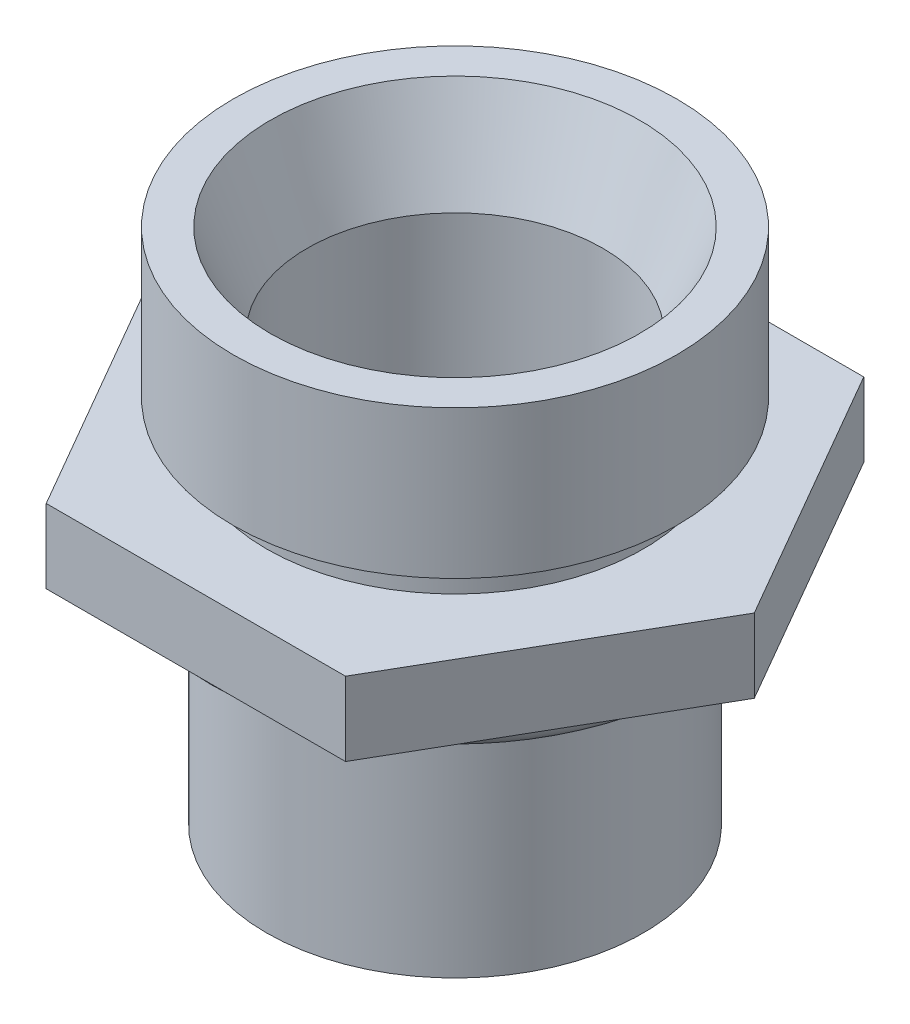
ISO-10303-21;
HEADER;
FILE_DESCRIPTION(('STEP AP214'),'2;1');
FILE_NAME('part.step','',(''),(''),'','','');
FILE_SCHEMA(('AUTOMOTIVE_DESIGN { 1 0 10303 214 1 1 1 1 }'));
ENDSEC;
DATA;
#1=APPLICATION_CONTEXT('core data for automotive mechanical design processes');
#2=APPLICATION_PROTOCOL_DEFINITION('international standard','automotive_design',2000,#1);
#3=PRODUCT_CONTEXT('',#1,'mechanical');
#4=PRODUCT('Part','Part','',(#3));
#5=PRODUCT_RELATED_PRODUCT_CATEGORY('part','',(#4));
#6=PRODUCT_DEFINITION_FORMATION('','',#4);
#7=PRODUCT_DEFINITION_CONTEXT('part definition',#1,'design');
#8=PRODUCT_DEFINITION('design','',#6,#7);
#9=PRODUCT_DEFINITION_SHAPE('','',#8);
#10=(LENGTH_UNIT() NAMED_UNIT(*) SI_UNIT(.MILLI.,.METRE.));
#11=(NAMED_UNIT(*) PLANE_ANGLE_UNIT() SI_UNIT($,.RADIAN.));
#12=(NAMED_UNIT(*) SI_UNIT($,.STERADIAN.) SOLID_ANGLE_UNIT());
#13=UNCERTAINTY_MEASURE_WITH_UNIT(LENGTH_MEASURE(1.E-05),#10,'distance_accuracy_value','');
#14=(GEOMETRIC_REPRESENTATION_CONTEXT(3) GLOBAL_UNCERTAINTY_ASSIGNED_CONTEXT((#13)) GLOBAL_UNIT_ASSIGNED_CONTEXT((#10,
#11,#12)) REPRESENTATION_CONTEXT('',''));
#15=CARTESIAN_POINT('',(0.,0.,0.));
#16=DIRECTION('',(0.,0.,1.));
#17=DIRECTION('',(1.,0.,0.));
#18=AXIS2_PLACEMENT_3D('',#15,#16,#17);
#19=CARTESIAN_POINT('',(0.,1.53750572311923,0.));
#20=DIRECTION('',(0.,1.,0.));
#21=DIRECTION('',(0.,0.,1.));
#22=AXIS2_PLACEMENT_3D('',#19,#20,#21);
#23=TOROIDAL_SURFACE('',#22,6.,0.8);
#24=CARTESIAN_POINT('',(0.,1.53750572311923,6.8));
#25=VERTEX_POINT('',#24);
#26=VERTEX_LOOP('',#25);
#27=FACE_BOUND('',#26,.T.);
#28=ADVANCED_FACE('F41',(#27),#23,.T.);
#29=CLOSED_SHELL('',(#28));
#30=MANIFOLD_SOLID_BREP('B2',#29);
#31=CARTESIAN_POINT('',(-8.1,1.43750572311923,0.));
#32=DIRECTION('',(0.,-1.,0.));
#33=DIRECTION('',(0.,0.,-1.));
#34=AXIS2_PLACEMENT_3D('',#31,#32,#33);
#35=PLANE('',#34);
#36=CARTESIAN_POINT('',(0.,1.43750572311923,0.));
#37=DIRECTION('',(0.,1.,0.));
#38=DIRECTION('',(0.,0.,1.));
#39=AXIS2_PLACEMENT_3D('',#36,#37,#38);
#40=CIRCLE('',#39,6.9);
#41=CARTESIAN_POINT('',(0.,1.43750572311923,6.9));
#42=VERTEX_POINT('',#41);
#43=EDGE_CURVE('E39',#42,#42,#40,.T.);
#44=ORIENTED_EDGE('',*,*,#43,.T.);
#45=EDGE_LOOP('',(#44));
#46=FACE_BOUND('',#45,.T.);
#47=DIRECTION('',(-0.999999992377329,0.,0.000123472032622339));
#48=VECTOR('',#47,1.);
#49=CARTESIAN_POINT('',(-8.09913385110908,1.43750572311923,7.01493986870678));
#50=LINE('',#49,#48);
#51=CARTESIAN_POINT('',(4.05036602540365,1.43750572311923,7.01343974525025));
#52=VERTEX_POINT('',#51);
#53=CARTESIAN_POINT('',(-4.04863397459637,1.43750572311923,7.01443974525008));
#54=VERTEX_POINT('',#53);
#55=EDGE_CURVE('E139',#52,#54,#50,.T.);
#56=ORIENTED_EDGE('',*,*,#55,.T.);
#57=DIRECTION('',(-0.500146037239615,0.,-0.8659410727258));
#58=VECTOR('',#57,1.);
#59=CARTESIAN_POINT('',(-8.1,1.43750572311923,0.));
#60=LINE('',#59,#58);
#61=CARTESIAN_POINT('',(-8.1,1.43750572311923,0.));
#62=VERTEX_POINT('',#61);
#63=EDGE_CURVE('E156',#54,#62,#60,.T.);
#64=ORIENTED_EDGE('',*,*,#63,.T.);
#65=DIRECTION('',(0.500039140324542,0.,-0.86600280492819));
#66=VECTOR('',#65,1.);
#67=CARTESIAN_POINT('',(-8.1,1.43750572311923,0.));
#68=LINE('',#67,#66);
#69=CARTESIAN_POINT('',(-4.05036602540369,1.43750572311923,-7.01343974525022));
#70=VERTEX_POINT('',#69);
#71=EDGE_CURVE('E153',#62,#70,#68,.T.);
#72=ORIENTED_EDGE('',*,*,#71,.T.);
#73=DIRECTION('',(0.999999992377329,0.,-0.000123472032629407));
#74=VECTOR('',#73,1.);
#75=CARTESIAN_POINT('',(-8.10086590191641,1.43750572311923,-7.01293962179349));
#76=LINE('',#75,#74);
#77=CARTESIAN_POINT('',(4.04863397459632,1.43750572311923,-7.01443974525011));
#78=VERTEX_POINT('',#77);
#79=EDGE_CURVE('E150',#70,#78,#76,.T.);
#80=ORIENTED_EDGE('',*,*,#79,.T.);
#81=DIRECTION('',(0.500146037239615,0.,0.8659410727258));
#82=VECTOR('',#81,1.);
#83=CARTESIAN_POINT('',(4.04763385122284,1.43750572311923,-7.01617133531064));
#84=LINE('',#83,#82);
#85=CARTESIAN_POINT('',(8.09999999999997,1.43750572311923,0.));
#86=VERTEX_POINT('',#85);
#87=EDGE_CURVE('E148',#78,#86,#84,.T.);
#88=ORIENTED_EDGE('',*,*,#87,.T.);
#89=DIRECTION('',(-0.500039140324542,0.,0.86600280492819));
#90=VECTOR('',#89,1.);
#91=CARTESIAN_POINT('',(4.04936590192456,1.43750572311923,7.01517182913792));
#92=LINE('',#91,#90);
#93=EDGE_CURVE('E109',#86,#52,#92,.T.);
#94=ORIENTED_EDGE('',*,*,#93,.T.);
#95=EDGE_LOOP('',(#56,#64,#72,#80,#88,#94));
#96=FACE_BOUND('',#95,.T.);
#97=ADVANCED_FACE('F54',(#46,#96),#35,.T.);
#98=CARTESIAN_POINT('',(-5.1,3.43750572311923,0.));
#99=DIRECTION('',(0.,1.,0.));
#100=DIRECTION('',(0.,0.,1.));
#101=AXIS2_PLACEMENT_3D('',#98,#99,#100);
#102=PLANE('',#101);
#103=CARTESIAN_POINT('',(0.,3.43750572311923,0.));
#104=DIRECTION('',(0.,1.,0.));
#105=DIRECTION('',(0.,0.,1.));
#106=AXIS2_PLACEMENT_3D('',#103,#104,#105);
#107=CIRCLE('',#106,5.1);
#108=CARTESIAN_POINT('',(0.,3.43750572311923,5.1));
#109=VERTEX_POINT('',#108);
#110=EDGE_CURVE('E159',#109,#109,#107,.T.);
#111=ORIENTED_EDGE('',*,*,#110,.F.);
#112=EDGE_LOOP('',(#111));
#113=FACE_BOUND('',#112,.T.);
#114=DIRECTION('',(-0.500039140324542,0.,0.86600280492819));
#115=VECTOR('',#114,1.);
#116=CARTESIAN_POINT('',(-8.1,3.43750572311923,0.));
#117=LINE('',#116,#115);
#118=CARTESIAN_POINT('',(-4.05036602540369,3.43750572311923,-7.01343974525022));
#119=VERTEX_POINT('',#118);
#120=CARTESIAN_POINT('',(-8.1,3.43750572311923,0.));
#121=VERTEX_POINT('',#120);
#122=EDGE_CURVE('E135',#119,#121,#117,.T.);
#123=ORIENTED_EDGE('',*,*,#122,.T.);
#124=DIRECTION('',(0.500146037239615,0.,0.8659410727258));
#125=VECTOR('',#124,1.);
#126=CARTESIAN_POINT('',(-4.04863397459637,3.43750572311923,7.01443974525008));
#127=LINE('',#126,#125);
#128=CARTESIAN_POINT('',(-4.04863397459637,3.43750572311923,7.01443974525008));
#129=VERTEX_POINT('',#128);
#130=EDGE_CURVE('E130',#121,#129,#127,.T.);
#131=ORIENTED_EDGE('',*,*,#130,.T.);
#132=DIRECTION('',(0.999999992377328,0.,-0.000123472032622339));
#133=VECTOR('',#132,1.);
#134=CARTESIAN_POINT('',(4.05036602540365,3.43750572311923,7.01343974525025));
#135=LINE('',#134,#133);
#136=CARTESIAN_POINT('',(4.05036602540365,3.43750572311923,7.01343974525025));
#137=VERTEX_POINT('',#136);
#138=EDGE_CURVE('E128',#129,#137,#135,.T.);
#139=ORIENTED_EDGE('',*,*,#138,.T.);
#140=DIRECTION('',(0.500039140324542,0.,-0.86600280492819));
#141=VECTOR('',#140,1.);
#142=CARTESIAN_POINT('',(8.09999999999997,3.43750572311923,0.));
#143=LINE('',#142,#141);
#144=CARTESIAN_POINT('',(8.09999999999997,3.43750572311923,0.));
#145=VERTEX_POINT('',#144);
#146=EDGE_CURVE('E76',#137,#145,#143,.T.);
#147=ORIENTED_EDGE('',*,*,#146,.T.);
#148=DIRECTION('',(-0.500146037239615,0.,-0.8659410727258));
#149=VECTOR('',#148,1.);
#150=CARTESIAN_POINT('',(4.04863397459632,3.43750572311923,-7.01443974525011));
#151=LINE('',#150,#149);
#152=CARTESIAN_POINT('',(4.04863397459632,3.43750572311923,-7.01443974525011));
#153=VERTEX_POINT('',#152);
#154=EDGE_CURVE('E116',#145,#153,#151,.T.);
#155=ORIENTED_EDGE('',*,*,#154,.T.);
#156=DIRECTION('',(-0.999999992377328,0.,0.000123472032629407));
#157=VECTOR('',#156,1.);
#158=CARTESIAN_POINT('',(-4.05036602540369,3.43750572311923,-7.01343974525022));
#159=LINE('',#158,#157);
#160=EDGE_CURVE('E122',#153,#119,#159,.T.);
#161=ORIENTED_EDGE('',*,*,#160,.T.);
#162=EDGE_LOOP('',(#123,#131,#139,#147,#155,#161));
#163=FACE_BOUND('',#162,.T.);
#164=ADVANCED_FACE('F126',(#113,#163),#102,.T.);
#165=CARTESIAN_POINT('',(0.,12.4404147941523,0.));
#166=DIRECTION('',(0.,1.,0.));
#167=DIRECTION('',(0.,0.,1.));
#168=AXIS2_PLACEMENT_3D('',#165,#166,#167);
#169=CYLINDRICAL_SURFACE('',#168,6.9);
#170=CARTESIAN_POINT('',(0.,2.43750572311923,0.));
#171=DIRECTION('',(0.,1.,0.));
#172=DIRECTION('',(0.,0.,1.));
#173=AXIS2_PLACEMENT_3D('',#170,#171,#172);
#174=CIRCLE('',#173,6.9);
#175=CARTESIAN_POINT('',(0.,2.43750572311923,6.9));
#176=VERTEX_POINT('',#175);
#177=EDGE_CURVE('E61',#176,#176,#174,.T.);
#178=ORIENTED_EDGE('',*,*,#177,.T.);
#179=EDGE_LOOP('',(#178));
#180=FACE_BOUND('',#179,.T.);
#181=ORIENTED_EDGE('',*,*,#43,.F.);
#182=EDGE_LOOP('',(#181));
#183=FACE_BOUND('',#182,.T.);
#184=ADVANCED_FACE('F188',(#180,#183),#169,.F.);
#185=CARTESIAN_POINT('',(-6.9,2.43750572311923,0.));
#186=DIRECTION('',(0.,-1.,0.));
#187=DIRECTION('',(0.,0.,-1.));
#188=AXIS2_PLACEMENT_3D('',#185,#186,#187);
#189=PLANE('',#188);
#190=CARTESIAN_POINT('',(0.,2.43750572311923,0.));
#191=DIRECTION('',(0.,1.,0.));
#192=DIRECTION('',(0.,0.,1.));
#193=AXIS2_PLACEMENT_3D('',#190,#191,#192);
#194=CIRCLE('',#193,5.1);
#195=CARTESIAN_POINT('',(0.,2.43750572311923,5.1));
#196=VERTEX_POINT('',#195);
#197=EDGE_CURVE('E183',#196,#196,#194,.T.);
#198=ORIENTED_EDGE('',*,*,#197,.T.);
#199=EDGE_LOOP('',(#198));
#200=FACE_BOUND('',#199,.T.);
#201=ORIENTED_EDGE('',*,*,#177,.F.);
#202=EDGE_LOOP('',(#201));
#203=FACE_BOUND('',#202,.T.);
#204=ADVANCED_FACE('F191',(#200,#203),#189,.T.);
#205=CARTESIAN_POINT('',(0.,12.4404147941523,0.));
#206=DIRECTION('',(0.,1.,0.));
#207=DIRECTION('',(0.,0.,1.));
#208=AXIS2_PLACEMENT_3D('',#205,#206,#207);
#209=CYLINDRICAL_SURFACE('',#208,5.1);
#210=CARTESIAN_POINT('',(0.,-5.56249427688077,0.));
#211=DIRECTION('',(0.,1.,0.));
#212=DIRECTION('',(0.,0.,1.));
#213=AXIS2_PLACEMENT_3D('',#210,#211,#212);
#214=CIRCLE('',#213,5.1);
#215=CARTESIAN_POINT('',(0.,-5.56249427688077,5.1));
#216=VERTEX_POINT('',#215);
#217=EDGE_CURVE('E180',#216,#216,#214,.T.);
#218=ORIENTED_EDGE('',*,*,#217,.T.);
#219=EDGE_LOOP('',(#218));
#220=FACE_BOUND('',#219,.T.);
#221=ORIENTED_EDGE('',*,*,#197,.F.);
#222=EDGE_LOOP('',(#221));
#223=FACE_BOUND('',#222,.T.);
#224=ADVANCED_FACE('F193',(#220,#223),#209,.T.);
#225=CARTESIAN_POINT('',(-5.1,-5.56249427688077,0.));
#226=DIRECTION('',(0.,-1.,0.));
#227=DIRECTION('',(0.,0.,-1.));
#228=AXIS2_PLACEMENT_3D('',#225,#226,#227);
#229=PLANE('',#228);
#230=CARTESIAN_POINT('',(0.,-5.56249427688077,0.));
#231=DIRECTION('',(0.,1.,0.));
#232=DIRECTION('',(0.,0.,1.));
#233=AXIS2_PLACEMENT_3D('',#230,#231,#232);
#234=CIRCLE('',#233,3.99999999999999);
#235=CARTESIAN_POINT('',(0.,-5.56249427688077,3.99999999999999));
#236=VERTEX_POINT('',#235);
#237=EDGE_CURVE('E177',#236,#236,#234,.T.);
#238=ORIENTED_EDGE('',*,*,#237,.T.);
#239=EDGE_LOOP('',(#238));
#240=FACE_BOUND('',#239,.T.);
#241=ORIENTED_EDGE('',*,*,#217,.F.);
#242=EDGE_LOOP('',(#241));
#243=FACE_BOUND('',#242,.T.);
#244=ADVANCED_FACE('F200',(#240,#243),#229,.T.);
#245=CARTESIAN_POINT('',(0.,12.4404147941523,0.));
#246=DIRECTION('',(0.,1.,0.));
#247=DIRECTION('',(0.,0.,1.));
#248=AXIS2_PLACEMENT_3D('',#245,#246,#247);
#249=CYLINDRICAL_SURFACE('',#248,3.99999999999999);
#250=CARTESIAN_POINT('',(0.,5.93750572311923,0.));
#251=DIRECTION('',(0.,1.,0.));
#252=DIRECTION('',(0.,0.,1.));
#253=AXIS2_PLACEMENT_3D('',#250,#251,#252);
#254=CIRCLE('',#253,3.99999999999999);
#255=CARTESIAN_POINT('',(0.,5.93750572311923,3.99999999999999));
#256=VERTEX_POINT('',#255);
#257=EDGE_CURVE('E174',#256,#256,#254,.T.);
#258=ORIENTED_EDGE('',*,*,#257,.T.);
#259=EDGE_LOOP('',(#258));
#260=FACE_BOUND('',#259,.T.);
#261=ORIENTED_EDGE('',*,*,#237,.F.);
#262=EDGE_LOOP('',(#261));
#263=FACE_BOUND('',#262,.T.);
#264=ADVANCED_FACE('F258',(#260,#263),#249,.F.);
#265=CARTESIAN_POINT('',(0.,5.93750572311923,0.));
#266=DIRECTION('',(0.,1.,0.));
#267=DIRECTION('',(0.,0.,1.));
#268=AXIS2_PLACEMENT_3D('',#265,#266,#267);
#269=CONICAL_SURFACE('',#268,3.99999999999999,0.380506377112361);
#270=CARTESIAN_POINT('',(0.,8.43750572311923,0.));
#271=DIRECTION('',(0.,1.,0.));
#272=DIRECTION('',(0.,0.,1.));
#273=AXIS2_PLACEMENT_3D('',#270,#271,#272);
#274=CIRCLE('',#273,4.99999999999998);
#275=CARTESIAN_POINT('',(0.,8.43750572311923,4.99999999999998));
#276=VERTEX_POINT('',#275);
#277=EDGE_CURVE('E171',#276,#276,#274,.T.);
#278=ORIENTED_EDGE('',*,*,#277,.T.);
#279=EDGE_LOOP('',(#278));
#280=FACE_BOUND('',#279,.T.);
#281=ORIENTED_EDGE('',*,*,#257,.F.);
#282=EDGE_LOOP('',(#281));
#283=FACE_BOUND('',#282,.T.);
#284=ADVANCED_FACE('F254',(#280,#283),#269,.F.);
#285=CARTESIAN_POINT('',(-6.,8.43750572311923,0.));
#286=DIRECTION('',(0.,1.,0.));
#287=DIRECTION('',(0.,0.,1.));
#288=AXIS2_PLACEMENT_3D('',#285,#286,#287);
#289=PLANE('',#288);
#290=CARTESIAN_POINT('',(0.,8.43750572311923,0.));
#291=DIRECTION('',(0.,1.,0.));
#292=DIRECTION('',(0.,0.,1.));
#293=AXIS2_PLACEMENT_3D('',#290,#291,#292);
#294=CIRCLE('',#293,6.);
#295=CARTESIAN_POINT('',(0.,8.43750572311923,6.));
#296=VERTEX_POINT('',#295);
#297=EDGE_CURVE('E168',#296,#296,#294,.T.);
#298=ORIENTED_EDGE('',*,*,#297,.T.);
#299=EDGE_LOOP('',(#298));
#300=FACE_BOUND('',#299,.T.);
#301=ORIENTED_EDGE('',*,*,#277,.F.);
#302=EDGE_LOOP('',(#301));
#303=FACE_BOUND('',#302,.T.);
#304=ADVANCED_FACE('F250',(#300,#303),#289,.T.);
#305=CARTESIAN_POINT('',(0.,12.4404147941523,0.));
#306=DIRECTION('',(0.,1.,0.));
#307=DIRECTION('',(0.,0.,1.));
#308=AXIS2_PLACEMENT_3D('',#305,#306,#307);
#309=CYLINDRICAL_SURFACE('',#308,5.99999999999999);
#310=CARTESIAN_POINT('',(0.,4.43750572311923,0.));
#311=DIRECTION('',(0.,1.,0.));
#312=DIRECTION('',(0.,0.,1.));
#313=AXIS2_PLACEMENT_3D('',#310,#311,#312);
#314=CIRCLE('',#313,5.99999999999999);
#315=CARTESIAN_POINT('',(0.,4.43750572311923,5.99999999999999));
#316=VERTEX_POINT('',#315);
#317=EDGE_CURVE('E165',#316,#316,#314,.T.);
#318=ORIENTED_EDGE('',*,*,#317,.T.);
#319=EDGE_LOOP('',(#318));
#320=FACE_BOUND('',#319,.T.);
#321=ORIENTED_EDGE('',*,*,#297,.F.);
#322=EDGE_LOOP('',(#321));
#323=FACE_BOUND('',#322,.T.);
#324=ADVANCED_FACE('F246',(#320,#323),#309,.T.);
#325=CARTESIAN_POINT('',(-5.1,4.43750572311923,0.));
#326=DIRECTION('',(0.,-1.,0.));
#327=DIRECTION('',(0.,0.,-1.));
#328=AXIS2_PLACEMENT_3D('',#325,#326,#327);
#329=PLANE('',#328);
#330=CARTESIAN_POINT('',(0.,4.43750572311923,0.));
#331=DIRECTION('',(0.,1.,0.));
#332=DIRECTION('',(0.,0.,1.));
#333=AXIS2_PLACEMENT_3D('',#330,#331,#332);
#334=CIRCLE('',#333,5.1);
#335=CARTESIAN_POINT('',(0.,4.43750572311923,5.1));
#336=VERTEX_POINT('',#335);
#337=EDGE_CURVE('E162',#336,#336,#334,.T.);
#338=ORIENTED_EDGE('',*,*,#337,.T.);
#339=EDGE_LOOP('',(#338));
#340=FACE_BOUND('',#339,.T.);
#341=ORIENTED_EDGE('',*,*,#317,.F.);
#342=EDGE_LOOP('',(#341));
#343=FACE_BOUND('',#342,.T.);
#344=ADVANCED_FACE('F242',(#340,#343),#329,.T.);
#345=CARTESIAN_POINT('',(0.,12.4404147941523,0.));
#346=DIRECTION('',(0.,1.,0.));
#347=DIRECTION('',(0.,0.,1.));
#348=AXIS2_PLACEMENT_3D('',#345,#346,#347);
#349=CYLINDRICAL_SURFACE('',#348,5.1);
#350=ORIENTED_EDGE('',*,*,#110,.T.);
#351=EDGE_LOOP('',(#350));
#352=FACE_BOUND('',#351,.T.);
#353=ORIENTED_EDGE('',*,*,#337,.F.);
#354=EDGE_LOOP('',(#353));
#355=FACE_BOUND('',#354,.T.);
#356=ADVANCED_FACE('F238',(#352,#355),#349,.T.);
#357=CARTESIAN_POINT('',(-4.04863397459637,-6.56249427688077,7.01443974525008));
#358=DIRECTION('',(-0.8659410727258,0.,0.500146037239615));
#359=DIRECTION('',(0.500146037239615,0.,0.8659410727258));
#360=AXIS2_PLACEMENT_3D('',#357,#358,#359);
#361=PLANE('',#360);
#362=DIRECTION('',(0.,1.,0.));
#363=VECTOR('',#362,1.);
#364=CARTESIAN_POINT('',(-4.04863397459637,-6.56249427688077,7.01443974525008));
#365=LINE('',#364,#363);
#366=EDGE_CURVE('E68',#54,#129,#365,.T.);
#367=ORIENTED_EDGE('',*,*,#366,.T.);
#368=ORIENTED_EDGE('',*,*,#130,.F.);
#369=DIRECTION('',(0.,1.,0.));
#370=VECTOR('',#369,1.);
#371=CARTESIAN_POINT('',(-8.1,-6.56249427688077,0.));
#372=LINE('',#371,#370);
#373=EDGE_CURVE('E137',#62,#121,#372,.T.);
#374=ORIENTED_EDGE('',*,*,#373,.F.);
#375=ORIENTED_EDGE('',*,*,#63,.F.);
#376=EDGE_LOOP('',(#367,#368,#374,#375));
#377=FACE_BOUND('',#376,.T.);
#378=ADVANCED_FACE('F218',(#377),#361,.T.);
#379=CARTESIAN_POINT('',(-8.1,-6.56249427688077,0.));
#380=DIRECTION('',(-0.86600280492819,0.,-0.500039140324542));
#381=DIRECTION('',(-0.500039140324542,0.,0.86600280492819));
#382=AXIS2_PLACEMENT_3D('',#379,#380,#381);
#383=PLANE('',#382);
#384=ORIENTED_EDGE('',*,*,#373,.T.);
#385=ORIENTED_EDGE('',*,*,#122,.F.);
#386=DIRECTION('',(0.,1.,0.));
#387=VECTOR('',#386,1.);
#388=CARTESIAN_POINT('',(-4.05036602540369,-6.56249427688077,-7.01343974525022));
#389=LINE('',#388,#387);
#390=EDGE_CURVE('E140',#70,#119,#389,.T.);
#391=ORIENTED_EDGE('',*,*,#390,.F.);
#392=ORIENTED_EDGE('',*,*,#71,.F.);
#393=EDGE_LOOP('',(#384,#385,#391,#392));
#394=FACE_BOUND('',#393,.T.);
#395=ADVANCED_FACE('F220',(#394),#383,.T.);
#396=CARTESIAN_POINT('',(-4.05036602540369,-6.56249427688077,-7.01343974525022));
#397=DIRECTION('',(-0.000123472032629407,0.,-0.999999992377329));
#398=DIRECTION('',(-0.999999992377329,0.,0.000123472032629407));
#399=AXIS2_PLACEMENT_3D('',#396,#397,#398);
#400=PLANE('',#399);
#401=ORIENTED_EDGE('',*,*,#390,.T.);
#402=ORIENTED_EDGE('',*,*,#160,.F.);
#403=DIRECTION('',(0.,1.,0.));
#404=VECTOR('',#403,1.);
#405=CARTESIAN_POINT('',(4.04863397459632,-6.56249427688077,-7.01443974525011));
#406=LINE('',#405,#404);
#407=EDGE_CURVE('E112',#78,#153,#406,.T.);
#408=ORIENTED_EDGE('',*,*,#407,.F.);
#409=ORIENTED_EDGE('',*,*,#79,.F.);
#410=EDGE_LOOP('',(#401,#402,#408,#409));
#411=FACE_BOUND('',#410,.T.);
#412=ADVANCED_FACE('F223',(#411),#400,.T.);
#413=CARTESIAN_POINT('',(4.04863397459632,-6.56249427688077,-7.01443974525011));
#414=DIRECTION('',(0.8659410727258,0.,-0.500146037239615));
#415=DIRECTION('',(-0.500146037239615,0.,-0.8659410727258));
#416=AXIS2_PLACEMENT_3D('',#413,#414,#415);
#417=PLANE('',#416);
#418=ORIENTED_EDGE('',*,*,#407,.T.);
#419=ORIENTED_EDGE('',*,*,#154,.F.);
#420=DIRECTION('',(0.,1.,0.));
#421=VECTOR('',#420,1.);
#422=CARTESIAN_POINT('',(8.09999999999997,-6.56249427688077,0.));
#423=LINE('',#422,#421);
#424=EDGE_CURVE('E105',#86,#145,#423,.T.);
#425=ORIENTED_EDGE('',*,*,#424,.F.);
#426=ORIENTED_EDGE('',*,*,#87,.F.);
#427=EDGE_LOOP('',(#418,#419,#425,#426));
#428=FACE_BOUND('',#427,.T.);
#429=ADVANCED_FACE('F117',(#428),#417,.T.);
#430=CARTESIAN_POINT('',(8.09999999999997,-6.56249427688077,0.));
#431=DIRECTION('',(0.86600280492819,0.,0.500039140324542));
#432=DIRECTION('',(0.500039140324542,0.,-0.86600280492819));
#433=AXIS2_PLACEMENT_3D('',#430,#431,#432);
#434=PLANE('',#433);
#435=ORIENTED_EDGE('',*,*,#424,.T.);
#436=ORIENTED_EDGE('',*,*,#146,.F.);
#437=DIRECTION('',(0.,1.,0.));
#438=VECTOR('',#437,1.);
#439=CARTESIAN_POINT('',(4.05036602540365,-6.56249427688077,7.01343974525025));
#440=LINE('',#439,#438);
#441=EDGE_CURVE('E113',#52,#137,#440,.T.);
#442=ORIENTED_EDGE('',*,*,#441,.F.);
#443=ORIENTED_EDGE('',*,*,#93,.F.);
#444=EDGE_LOOP('',(#435,#436,#442,#443));
#445=FACE_BOUND('',#444,.T.);
#446=ADVANCED_FACE('F107',(#445),#434,.T.);
#447=CARTESIAN_POINT('',(4.05036602540365,-6.56249427688077,7.01343974525025));
#448=DIRECTION('',(0.000123472032622339,0.,0.999999992377329));
#449=DIRECTION('',(0.999999992377329,0.,-0.000123472032622339));
#450=AXIS2_PLACEMENT_3D('',#447,#448,#449);
#451=PLANE('',#450);
#452=ORIENTED_EDGE('',*,*,#441,.T.);
#453=ORIENTED_EDGE('',*,*,#138,.F.);
#454=ORIENTED_EDGE('',*,*,#366,.F.);
#455=ORIENTED_EDGE('',*,*,#55,.F.);
#456=EDGE_LOOP('',(#452,#453,#454,#455));
#457=FACE_BOUND('',#456,.T.);
#458=ADVANCED_FACE('F213',(#457),#451,.T.);
#459=CLOSED_SHELL('',(#97,#164,#184,#204,#224,#244,#264,#284,#304,#324,#344,#356,#378,#395,#412,
#429,#446,#458));
#460=MANIFOLD_SOLID_BREP('B6',#459);
#461=ADVANCED_BREP_SHAPE_REPRESENTATION('',(#18,#30,#460),#14);
#462=SHAPE_DEFINITION_REPRESENTATION(#9,#461);
ENDSEC;
END-ISO-10303-21;
